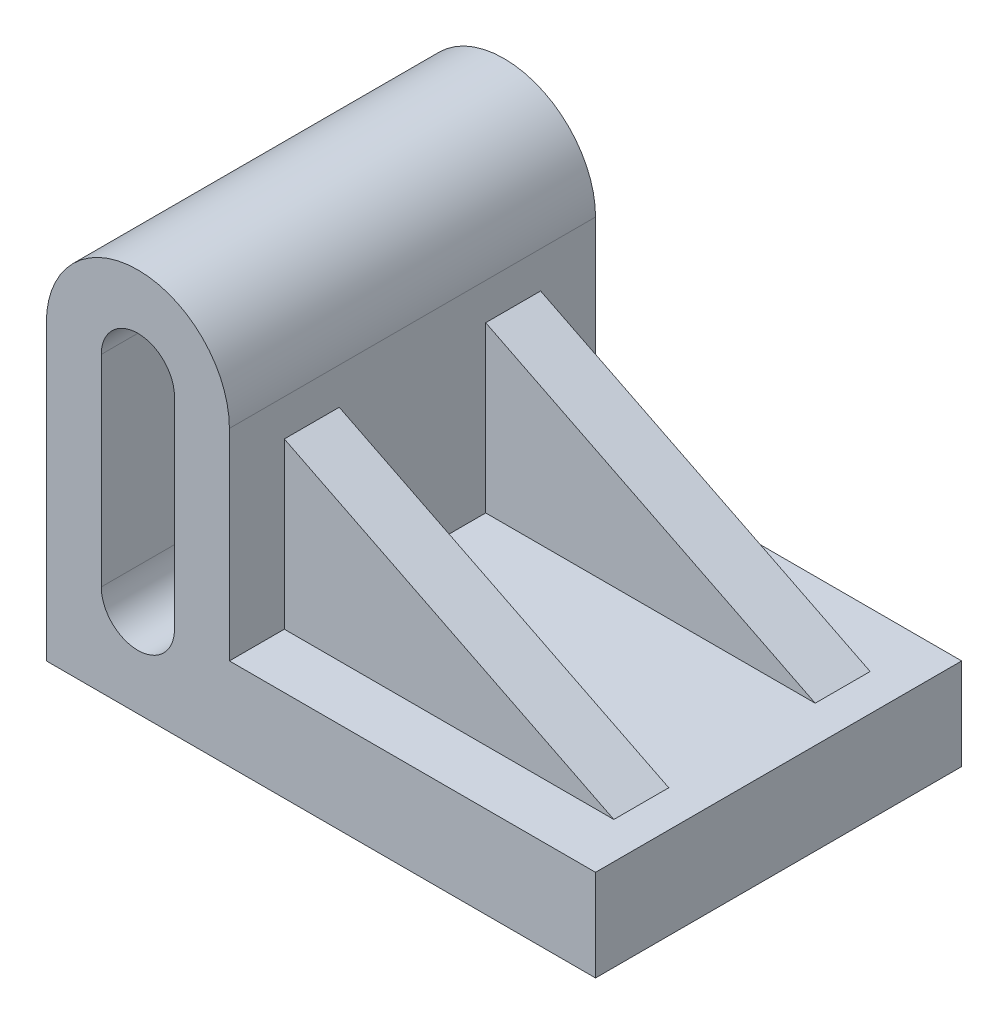
ISO-10303-21;
HEADER;
FILE_DESCRIPTION(('STEP AP214'),'2;1');
FILE_NAME('part.step','',(''),(''),'','','');
FILE_SCHEMA(('AUTOMOTIVE_DESIGN { 1 0 10303 214 1 1 1 1 }'));
ENDSEC;
DATA;
#1=APPLICATION_CONTEXT('core data for automotive mechanical design processes');
#2=APPLICATION_PROTOCOL_DEFINITION('international standard','automotive_design',2000,#1);
#3=PRODUCT_CONTEXT('',#1,'mechanical');
#4=PRODUCT('Part','Part','',(#3));
#5=PRODUCT_RELATED_PRODUCT_CATEGORY('part','',(#4));
#6=PRODUCT_DEFINITION_FORMATION('','',#4);
#7=PRODUCT_DEFINITION_CONTEXT('part definition',#1,'design');
#8=PRODUCT_DEFINITION('design','',#6,#7);
#9=PRODUCT_DEFINITION_SHAPE('','',#8);
#10=(LENGTH_UNIT() NAMED_UNIT(*) SI_UNIT(.MILLI.,.METRE.));
#11=(NAMED_UNIT(*) PLANE_ANGLE_UNIT() SI_UNIT($,.RADIAN.));
#12=(NAMED_UNIT(*) SI_UNIT($,.STERADIAN.) SOLID_ANGLE_UNIT());
#13=UNCERTAINTY_MEASURE_WITH_UNIT(LENGTH_MEASURE(1.E-05),#10,'distance_accuracy_value','');
#14=(GEOMETRIC_REPRESENTATION_CONTEXT(3) GLOBAL_UNCERTAINTY_ASSIGNED_CONTEXT((#13)) GLOBAL_UNIT_ASSIGNED_CONTEXT((#10,
#11,#12)) REPRESENTATION_CONTEXT('',''));
#15=CARTESIAN_POINT('',(0.,0.,0.));
#16=DIRECTION('',(0.,0.,1.));
#17=DIRECTION('',(1.,0.,0.));
#18=AXIS2_PLACEMENT_3D('',#15,#16,#17);
#19=CARTESIAN_POINT('',(-52.1171171171171,57.8153153153153,-100.));
#20=DIRECTION('',(1.,0.,0.));
#21=DIRECTION('',(0.,1.,0.));
#22=AXIS2_PLACEMENT_3D('',#19,#20,#21);
#23=PLANE('',#22);
#24=DIRECTION('',(0.,1.,0.));
#25=VECTOR('',#24,1.);
#26=CARTESIAN_POINT('',(-52.1171171171172,47.8153153153153,-70.));
#27=LINE('',#26,#25);
#28=CARTESIAN_POINT('',(-52.1171171171172,2.81531531531532,-70.));
#29=VERTEX_POINT('',#28);
#30=CARTESIAN_POINT('',(-52.1171171171171,47.8153153153153,-70.));
#31=VERTEX_POINT('',#30);
#32=EDGE_CURVE('E181',#29,#31,#27,.T.);
#33=ORIENTED_EDGE('',*,*,#32,.T.);
#34=DIRECTION('',(0.,0.,1.));
#35=VECTOR('',#34,1.);
#36=CARTESIAN_POINT('',(-52.1171171171171,47.8153153153153,-15.));
#37=LINE('',#36,#35);
#38=CARTESIAN_POINT('',(-52.1171171171171,47.8153153153153,-85.));
#39=VERTEX_POINT('',#38);
#40=EDGE_CURVE('E61',#39,#31,#37,.T.);
#41=ORIENTED_EDGE('',*,*,#40,.F.);
#42=DIRECTION('',(0.,-1.,0.));
#43=VECTOR('',#42,1.);
#44=CARTESIAN_POINT('',(-52.1171171171171,47.8153153153153,-85.));
#45=LINE('',#44,#43);
#46=CARTESIAN_POINT('',(-52.1171171171171,2.81531531531532,-85.));
#47=VERTEX_POINT('',#46);
#48=EDGE_CURVE('E170',#39,#47,#45,.T.);
#49=ORIENTED_EDGE('',*,*,#48,.T.);
#50=DIRECTION('',(0.,0.,1.));
#51=VECTOR('',#50,1.);
#52=CARTESIAN_POINT('',(-52.1171171171171,2.81531531531532,-100.));
#53=LINE('',#52,#51);
#54=CARTESIAN_POINT('',(-52.1171171171171,2.81531531531532,-100.));
#55=VERTEX_POINT('',#54);
#56=EDGE_CURVE('E293',#55,#47,#53,.T.);
#57=ORIENTED_EDGE('',*,*,#56,.F.);
#58=DIRECTION('',(0.,1.,0.));
#59=VECTOR('',#58,1.);
#60=CARTESIAN_POINT('',(-52.1171171171171,57.8153153153153,-100.));
#61=LINE('',#60,#59);
#62=CARTESIAN_POINT('',(-52.1171171171171,57.8153153153153,-100.));
#63=VERTEX_POINT('',#62);
#64=EDGE_CURVE('E264',#55,#63,#61,.T.);
#65=ORIENTED_EDGE('',*,*,#64,.T.);
#66=DIRECTION('',(0.,0.,1.));
#67=VECTOR('',#66,1.);
#68=CARTESIAN_POINT('',(-52.1171171171171,57.8153153153153,-100.));
#69=LINE('',#68,#67);
#70=CARTESIAN_POINT('',(-52.1171171171171,57.8153153153153,0.));
#71=VERTEX_POINT('',#70);
#72=EDGE_CURVE('E54',#63,#71,#69,.T.);
#73=ORIENTED_EDGE('',*,*,#72,.T.);
#74=DIRECTION('',(0.,1.,0.));
#75=VECTOR('',#74,1.);
#76=CARTESIAN_POINT('',(-52.1171171171171,57.8153153153153,0.));
#77=LINE('',#76,#75);
#78=CARTESIAN_POINT('',(-52.1171171171171,2.81531531531532,0.));
#79=VERTEX_POINT('',#78);
#80=EDGE_CURVE('E249',#79,#71,#77,.T.);
#81=ORIENTED_EDGE('',*,*,#80,.F.);
#82=CARTESIAN_POINT('',(-52.1171171171171,2.81531531531532,-15.));
#83=VERTEX_POINT('',#82);
#84=EDGE_CURVE('E296',#83,#79,#53,.T.);
#85=ORIENTED_EDGE('',*,*,#84,.F.);
#86=DIRECTION('',(0.,-1.,0.));
#87=VECTOR('',#86,1.);
#88=CARTESIAN_POINT('',(-52.1171171171171,47.8153153153153,-15.));
#89=LINE('',#88,#87);
#90=CARTESIAN_POINT('',(-52.1171171171171,47.8153153153153,-15.));
#91=VERTEX_POINT('',#90);
#92=EDGE_CURVE('E68',#91,#83,#89,.T.);
#93=ORIENTED_EDGE('',*,*,#92,.F.);
#94=CARTESIAN_POINT('',(-52.1171171171171,47.8153153153153,-30.));
#95=VERTEX_POINT('',#94);
#96=EDGE_CURVE('E183',#95,#91,#37,.T.);
#97=ORIENTED_EDGE('',*,*,#96,.F.);
#98=DIRECTION('',(0.,-1.,0.));
#99=VECTOR('',#98,1.);
#100=CARTESIAN_POINT('',(-52.1171171171171,47.8153153153153,-30.));
#101=LINE('',#100,#99);
#102=CARTESIAN_POINT('',(-52.1171171171171,2.81531531531532,-30.));
#103=VERTEX_POINT('',#102);
#104=EDGE_CURVE('E343',#95,#103,#101,.T.);
#105=ORIENTED_EDGE('',*,*,#104,.T.);
#106=DIRECTION('',(0.,0.,-1.));
#107=VECTOR('',#106,1.);
#108=CARTESIAN_POINT('',(-52.1171171171171,2.81531531531532,-30.));
#109=LINE('',#108,#107);
#110=EDGE_CURVE('E352',#103,#29,#109,.T.);
#111=ORIENTED_EDGE('',*,*,#110,.T.);
#112=EDGE_LOOP('',(#33,#41,#49,#57,#65,#73,#81,#85,#93,#97,#105,#111));
#113=FACE_BOUND('',#112,.T.);
#114=ADVANCED_FACE('F45',(#113),#23,.T.);
#115=CARTESIAN_POINT('',(47.8828828828829,2.81531531531532,-100.));
#116=DIRECTION('',(0.,1.,0.));
#117=DIRECTION('',(-1.,0.,0.));
#118=AXIS2_PLACEMENT_3D('',#115,#116,#117);
#119=PLANE('',#118);
#120=DIRECTION('',(1.,0.,0.));
#121=VECTOR('',#120,1.);
#122=CARTESIAN_POINT('',(-52.1171171171171,2.81531531531532,-30.));
#123=LINE('',#122,#121);
#124=CARTESIAN_POINT('',(37.8828828828828,2.81531531531532,-30.));
#125=VERTEX_POINT('',#124);
#126=EDGE_CURVE('E191',#103,#125,#123,.T.);
#127=ORIENTED_EDGE('',*,*,#126,.T.);
#128=DIRECTION('',(0.,0.,-1.));
#129=VECTOR('',#128,1.);
#130=CARTESIAN_POINT('',(37.8828828828828,2.81531531531532,-15.));
#131=LINE('',#130,#129);
#132=CARTESIAN_POINT('',(37.8828828828828,2.81531531531532,-15.));
#133=VERTEX_POINT('',#132);
#134=EDGE_CURVE('E193',#133,#125,#131,.T.);
#135=ORIENTED_EDGE('',*,*,#134,.F.);
#136=DIRECTION('',(1.,0.,0.));
#137=VECTOR('',#136,1.);
#138=CARTESIAN_POINT('',(37.8828828828828,2.81531531531532,-15.));
#139=LINE('',#138,#137);
#140=EDGE_CURVE('E188',#83,#133,#139,.T.);
#141=ORIENTED_EDGE('',*,*,#140,.F.);
#142=ORIENTED_EDGE('',*,*,#84,.T.);
#143=DIRECTION('',(-1.,0.,0.));
#144=VECTOR('',#143,1.);
#145=CARTESIAN_POINT('',(47.8828828828829,2.81531531531532,0.));
#146=LINE('',#145,#144);
#147=CARTESIAN_POINT('',(47.8828828828829,2.81531531531532,0.));
#148=VERTEX_POINT('',#147);
#149=EDGE_CURVE('E284',#148,#79,#146,.T.);
#150=ORIENTED_EDGE('',*,*,#149,.F.);
#151=DIRECTION('',(0.,0.,1.));
#152=VECTOR('',#151,1.);
#153=CARTESIAN_POINT('',(47.8828828828829,2.81531531531532,-100.));
#154=LINE('',#153,#152);
#155=CARTESIAN_POINT('',(47.8828828828829,2.81531531531532,-100.));
#156=VERTEX_POINT('',#155);
#157=EDGE_CURVE('E297',#156,#148,#154,.T.);
#158=ORIENTED_EDGE('',*,*,#157,.F.);
#159=DIRECTION('',(-1.,0.,0.));
#160=VECTOR('',#159,1.);
#161=CARTESIAN_POINT('',(47.8828828828829,2.81531531531532,-100.));
#162=LINE('',#161,#160);
#163=EDGE_CURVE('E260',#156,#55,#162,.T.);
#164=ORIENTED_EDGE('',*,*,#163,.T.);
#165=ORIENTED_EDGE('',*,*,#56,.T.);
#166=DIRECTION('',(-1.,0.,0.));
#167=VECTOR('',#166,1.);
#168=CARTESIAN_POINT('',(37.8828828828828,2.81531531531532,-85.));
#169=LINE('',#168,#167);
#170=CARTESIAN_POINT('',(37.8828828828828,2.81531531531532,-85.));
#171=VERTEX_POINT('',#170);
#172=EDGE_CURVE('E172',#171,#47,#169,.T.);
#173=ORIENTED_EDGE('',*,*,#172,.F.);
#174=CARTESIAN_POINT('',(37.8828828828828,2.81531531531532,-70.));
#175=VERTEX_POINT('',#174);
#176=EDGE_CURVE('E162',#175,#171,#131,.T.);
#177=ORIENTED_EDGE('',*,*,#176,.F.);
#178=DIRECTION('',(1.,0.,0.));
#179=VECTOR('',#178,1.);
#180=CARTESIAN_POINT('',(-52.1171171171172,2.81531531531532,-70.));
#181=LINE('',#180,#179);
#182=EDGE_CURVE('E358',#29,#175,#181,.T.);
#183=ORIENTED_EDGE('',*,*,#182,.F.);
#184=ORIENTED_EDGE('',*,*,#110,.F.);
#185=EDGE_LOOP('',(#127,#135,#141,#142,#150,#158,#164,#165,#173,#177,#183,#184));
#186=FACE_BOUND('',#185,.T.);
#187=ADVANCED_FACE('F333',(#186),#119,.T.);
#188=CARTESIAN_POINT('',(-77.1171171171171,57.8153153153153,-100.));
#189=DIRECTION('',(0.,0.,1.));
#190=DIRECTION('',(1.,0.,0.));
#191=AXIS2_PLACEMENT_3D('',#188,#189,#190);
#192=CYLINDRICAL_SURFACE('',#191,25.);
#193=CARTESIAN_POINT('',(-77.1171171171171,57.8153153153153,0.));
#194=DIRECTION('',(0.,0.,1.));
#195=DIRECTION('',(1.,0.,0.));
#196=AXIS2_PLACEMENT_3D('',#193,#194,#195);
#197=CIRCLE('',#196,25.);
#198=CARTESIAN_POINT('',(-102.117117117117,57.8153153153153,0.));
#199=VERTEX_POINT('',#198);
#200=EDGE_CURVE('E234',#71,#199,#197,.T.);
#201=ORIENTED_EDGE('',*,*,#200,.F.);
#202=ORIENTED_EDGE('',*,*,#72,.F.);
#203=CARTESIAN_POINT('',(-77.1171171171171,57.8153153153153,-100.));
#204=DIRECTION('',(0.,0.,1.));
#205=DIRECTION('',(1.,0.,0.));
#206=AXIS2_PLACEMENT_3D('',#203,#204,#205);
#207=CIRCLE('',#206,25.);
#208=CARTESIAN_POINT('',(-102.117117117117,57.8153153153153,-100.));
#209=VERTEX_POINT('',#208);
#210=EDGE_CURVE('E244',#63,#209,#207,.T.);
#211=ORIENTED_EDGE('',*,*,#210,.T.);
#212=DIRECTION('',(0.,0.,1.));
#213=VECTOR('',#212,1.);
#214=CARTESIAN_POINT('',(-102.117117117117,57.8153153153153,-100.));
#215=LINE('',#214,#213);
#216=EDGE_CURVE('E268',#209,#199,#215,.T.);
#217=ORIENTED_EDGE('',*,*,#216,.T.);
#218=EDGE_LOOP('',(#201,#202,#211,#217));
#219=FACE_BOUND('',#218,.T.);
#220=ADVANCED_FACE('F47',(#219),#192,.T.);
#221=CARTESIAN_POINT('',(47.8828828828829,-22.1846846846847,-100.));
#222=DIRECTION('',(1.,0.,0.));
#223=DIRECTION('',(0.,0.,-1.));
#224=AXIS2_PLACEMENT_3D('',#221,#222,#223);
#225=PLANE('',#224);
#226=DIRECTION('',(0.,1.,0.));
#227=VECTOR('',#226,1.);
#228=CARTESIAN_POINT('',(47.8828828828829,-22.1846846846847,0.));
#229=LINE('',#228,#227);
#230=CARTESIAN_POINT('',(47.8828828828829,-22.1846846846847,0.));
#231=VERTEX_POINT('',#230);
#232=EDGE_CURVE('E280',#231,#148,#229,.T.);
#233=ORIENTED_EDGE('',*,*,#232,.F.);
#234=DIRECTION('',(0.,0.,1.));
#235=VECTOR('',#234,1.);
#236=CARTESIAN_POINT('',(47.8828828828829,-22.1846846846847,-100.));
#237=LINE('',#236,#235);
#238=CARTESIAN_POINT('',(47.8828828828829,-22.1846846846847,-100.));
#239=VERTEX_POINT('',#238);
#240=EDGE_CURVE('E300',#239,#231,#237,.T.);
#241=ORIENTED_EDGE('',*,*,#240,.F.);
#242=DIRECTION('',(0.,1.,0.));
#243=VECTOR('',#242,1.);
#244=CARTESIAN_POINT('',(47.8828828828829,-22.1846846846847,-100.));
#245=LINE('',#244,#243);
#246=EDGE_CURVE('E256',#239,#156,#245,.T.);
#247=ORIENTED_EDGE('',*,*,#246,.T.);
#248=ORIENTED_EDGE('',*,*,#157,.T.);
#249=EDGE_LOOP('',(#233,#241,#247,#248));
#250=FACE_BOUND('',#249,.T.);
#251=ADVANCED_FACE('F330',(#250),#225,.T.);
#252=CARTESIAN_POINT('',(-102.117117117117,-22.1846846846847,-100.));
#253=DIRECTION('',(0.,-1.,0.));
#254=DIRECTION('',(0.,0.,-1.));
#255=AXIS2_PLACEMENT_3D('',#252,#253,#254);
#256=PLANE('',#255);
#257=DIRECTION('',(1.,0.,0.));
#258=VECTOR('',#257,1.);
#259=CARTESIAN_POINT('',(-102.117117117117,-22.1846846846847,0.));
#260=LINE('',#259,#258);
#261=CARTESIAN_POINT('',(-102.117117117117,-22.1846846846847,0.));
#262=VERTEX_POINT('',#261);
#263=EDGE_CURVE('E276',#262,#231,#260,.T.);
#264=ORIENTED_EDGE('',*,*,#263,.F.);
#265=DIRECTION('',(0.,0.,1.));
#266=VECTOR('',#265,1.);
#267=CARTESIAN_POINT('',(-102.117117117117,-22.1846846846847,-100.));
#268=LINE('',#267,#266);
#269=CARTESIAN_POINT('',(-102.117117117117,-22.1846846846847,-100.));
#270=VERTEX_POINT('',#269);
#271=EDGE_CURVE('E303',#270,#262,#268,.T.);
#272=ORIENTED_EDGE('',*,*,#271,.F.);
#273=DIRECTION('',(1.,0.,0.));
#274=VECTOR('',#273,1.);
#275=CARTESIAN_POINT('',(-102.117117117117,-22.1846846846847,-100.));
#276=LINE('',#275,#274);
#277=EDGE_CURVE('E252',#270,#239,#276,.T.);
#278=ORIENTED_EDGE('',*,*,#277,.T.);
#279=ORIENTED_EDGE('',*,*,#240,.T.);
#280=EDGE_LOOP('',(#264,#272,#278,#279));
#281=FACE_BOUND('',#280,.T.);
#282=ADVANCED_FACE('F327',(#281),#256,.T.);
#283=CARTESIAN_POINT('',(-102.117117117117,2.81531531531532,-100.));
#284=DIRECTION('',(-1.,0.,0.));
#285=DIRECTION('',(0.,-1.,0.));
#286=AXIS2_PLACEMENT_3D('',#283,#284,#285);
#287=PLANE('',#286);
#288=DIRECTION('',(0.,-1.,0.));
#289=VECTOR('',#288,1.);
#290=CARTESIAN_POINT('',(-102.117117117117,2.81531531531532,0.));
#291=LINE('',#290,#289);
#292=EDGE_CURVE('E272',#199,#262,#291,.T.);
#293=ORIENTED_EDGE('',*,*,#292,.F.);
#294=ORIENTED_EDGE('',*,*,#216,.F.);
#295=DIRECTION('',(0.,-1.,0.));
#296=VECTOR('',#295,1.);
#297=CARTESIAN_POINT('',(-102.117117117117,57.8153153153153,-100.));
#298=LINE('',#297,#296);
#299=EDGE_CURVE('E248',#209,#270,#298,.T.);
#300=ORIENTED_EDGE('',*,*,#299,.T.);
#301=ORIENTED_EDGE('',*,*,#271,.T.);
#302=EDGE_LOOP('',(#293,#294,#300,#301));
#303=FACE_BOUND('',#302,.T.);
#304=ADVANCED_FACE('F324',(#303),#287,.T.);
#305=CARTESIAN_POINT('',(-77.1171171171171,57.8153153153153,-100.));
#306=DIRECTION('',(0.,0.,1.));
#307=DIRECTION('',(1.,0.,0.));
#308=AXIS2_PLACEMENT_3D('',#305,#306,#307);
#309=PLANE('',#308);
#310=DIRECTION('',(0.,1.,0.));
#311=VECTOR('',#310,1.);
#312=CARTESIAN_POINT('',(-67.1171171171171,57.8153153153153,-100.));
#313=LINE('',#312,#311);
#314=CARTESIAN_POINT('',(-67.1171171171171,2.81531531531532,-100.));
#315=VERTEX_POINT('',#314);
#316=CARTESIAN_POINT('',(-67.1171171171171,57.8153153153153,-100.));
#317=VERTEX_POINT('',#316);
#318=EDGE_CURVE('E213',#315,#317,#313,.T.);
#319=ORIENTED_EDGE('',*,*,#318,.T.);
#320=CARTESIAN_POINT('',(-77.1171171171171,57.8153153153153,-100.));
#321=DIRECTION('',(0.,0.,1.));
#322=DIRECTION('',(1.,0.,0.));
#323=AXIS2_PLACEMENT_3D('',#320,#321,#322);
#324=CIRCLE('',#323,10.);
#325=CARTESIAN_POINT('',(-87.1171171171171,57.8153153153153,-100.));
#326=VERTEX_POINT('',#325);
#327=EDGE_CURVE('E200',#317,#326,#324,.T.);
#328=ORIENTED_EDGE('',*,*,#327,.T.);
#329=DIRECTION('',(0.,-1.,0.));
#330=VECTOR('',#329,1.);
#331=CARTESIAN_POINT('',(-87.1171171171171,57.8153153153153,-100.));
#332=LINE('',#331,#330);
#333=CARTESIAN_POINT('',(-87.1171171171171,2.81531531531532,-100.));
#334=VERTEX_POINT('',#333);
#335=EDGE_CURVE('E204',#326,#334,#332,.T.);
#336=ORIENTED_EDGE('',*,*,#335,.T.);
#337=CARTESIAN_POINT('',(-77.1171171171171,2.81531531531532,-100.));
#338=DIRECTION('',(0.,0.,1.));
#339=DIRECTION('',(1.,0.,0.));
#340=AXIS2_PLACEMENT_3D('',#337,#338,#339);
#341=CIRCLE('',#340,9.99999999999997);
#342=EDGE_CURVE('E209',#334,#315,#341,.T.);
#343=ORIENTED_EDGE('',*,*,#342,.T.);
#344=EDGE_LOOP('',(#319,#328,#336,#343));
#345=FACE_BOUND('',#344,.T.);
#346=ORIENTED_EDGE('',*,*,#210,.F.);
#347=ORIENTED_EDGE('',*,*,#64,.F.);
#348=ORIENTED_EDGE('',*,*,#163,.F.);
#349=ORIENTED_EDGE('',*,*,#246,.F.);
#350=ORIENTED_EDGE('',*,*,#277,.F.);
#351=ORIENTED_EDGE('',*,*,#299,.F.);
#352=EDGE_LOOP('',(#346,#347,#348,#349,#350,#351));
#353=FACE_BOUND('',#352,.T.);
#354=ADVANCED_FACE('F319',(#345,#353),#309,.F.);
#355=CARTESIAN_POINT('',(-77.1171171171171,57.8153153153153,0.));
#356=DIRECTION('',(0.,0.,1.));
#357=DIRECTION('',(1.,0.,0.));
#358=AXIS2_PLACEMENT_3D('',#355,#356,#357);
#359=PLANE('',#358);
#360=CARTESIAN_POINT('',(-77.1171171171171,57.8153153153153,0.));
#361=DIRECTION('',(0.,0.,1.));
#362=DIRECTION('',(1.,0.,0.));
#363=AXIS2_PLACEMENT_3D('',#360,#361,#362);
#364=CIRCLE('',#363,10.);
#365=CARTESIAN_POINT('',(-67.1171171171171,57.8153153153153,0.));
#366=VERTEX_POINT('',#365);
#367=CARTESIAN_POINT('',(-87.1171171171171,57.8153153153153,0.));
#368=VERTEX_POINT('',#367);
#369=EDGE_CURVE('E176',#366,#368,#364,.T.);
#370=ORIENTED_EDGE('',*,*,#369,.F.);
#371=DIRECTION('',(0.,1.,0.));
#372=VECTOR('',#371,1.);
#373=CARTESIAN_POINT('',(-67.1171171171171,57.8153153153153,0.));
#374=LINE('',#373,#372);
#375=CARTESIAN_POINT('',(-67.1171171171171,2.81531531531532,0.));
#376=VERTEX_POINT('',#375);
#377=EDGE_CURVE('E205',#376,#366,#374,.T.);
#378=ORIENTED_EDGE('',*,*,#377,.F.);
#379=CARTESIAN_POINT('',(-77.1171171171171,2.81531531531532,0.));
#380=DIRECTION('',(0.,0.,1.));
#381=DIRECTION('',(1.,0.,0.));
#382=AXIS2_PLACEMENT_3D('',#379,#380,#381);
#383=CIRCLE('',#382,9.99999999999997);
#384=CARTESIAN_POINT('',(-87.1171171171171,2.81531531531532,0.));
#385=VERTEX_POINT('',#384);
#386=EDGE_CURVE('E224',#385,#376,#383,.T.);
#387=ORIENTED_EDGE('',*,*,#386,.F.);
#388=DIRECTION('',(0.,-1.,0.));
#389=VECTOR('',#388,1.);
#390=CARTESIAN_POINT('',(-87.1171171171171,57.8153153153153,0.));
#391=LINE('',#390,#389);
#392=EDGE_CURVE('E220',#368,#385,#391,.T.);
#393=ORIENTED_EDGE('',*,*,#392,.F.);
#394=EDGE_LOOP('',(#370,#378,#387,#393));
#395=FACE_BOUND('',#394,.T.);
#396=ORIENTED_EDGE('',*,*,#200,.T.);
#397=ORIENTED_EDGE('',*,*,#292,.T.);
#398=ORIENTED_EDGE('',*,*,#263,.T.);
#399=ORIENTED_EDGE('',*,*,#232,.T.);
#400=ORIENTED_EDGE('',*,*,#149,.T.);
#401=ORIENTED_EDGE('',*,*,#80,.T.);
#402=EDGE_LOOP('',(#396,#397,#398,#399,#400,#401));
#403=FACE_BOUND('',#402,.T.);
#404=ADVANCED_FACE('F313',(#395,#403),#359,.T.);
#405=CARTESIAN_POINT('',(-77.1171171171171,57.8153153153153,-100.));
#406=DIRECTION('',(0.,0.,1.));
#407=DIRECTION('',(1.,0.,0.));
#408=AXIS2_PLACEMENT_3D('',#405,#406,#407);
#409=CYLINDRICAL_SURFACE('',#408,10.);
#410=ORIENTED_EDGE('',*,*,#369,.T.);
#411=DIRECTION('',(0.,0.,1.));
#412=VECTOR('',#411,1.);
#413=CARTESIAN_POINT('',(-87.1171171171171,57.8153153153153,-100.));
#414=LINE('',#413,#412);
#415=EDGE_CURVE('E217',#326,#368,#414,.T.);
#416=ORIENTED_EDGE('',*,*,#415,.F.);
#417=ORIENTED_EDGE('',*,*,#327,.F.);
#418=DIRECTION('',(0.,0.,1.));
#419=VECTOR('',#418,1.);
#420=CARTESIAN_POINT('',(-67.1171171171171,57.8153153153153,-100.));
#421=LINE('',#420,#419);
#422=EDGE_CURVE('E231',#317,#366,#421,.T.);
#423=ORIENTED_EDGE('',*,*,#422,.T.);
#424=EDGE_LOOP('',(#410,#416,#417,#423));
#425=FACE_BOUND('',#424,.T.);
#426=ADVANCED_FACE('F394',(#425),#409,.F.);
#427=CARTESIAN_POINT('',(-67.1171171171171,57.8153153153153,-100.));
#428=DIRECTION('',(1.,0.,0.));
#429=DIRECTION('',(0.,1.,0.));
#430=AXIS2_PLACEMENT_3D('',#427,#428,#429);
#431=PLANE('',#430);
#432=ORIENTED_EDGE('',*,*,#377,.T.);
#433=ORIENTED_EDGE('',*,*,#422,.F.);
#434=ORIENTED_EDGE('',*,*,#318,.F.);
#435=DIRECTION('',(0.,0.,1.));
#436=VECTOR('',#435,1.);
#437=CARTESIAN_POINT('',(-67.1171171171171,2.81531531531532,-100.));
#438=LINE('',#437,#436);
#439=EDGE_CURVE('E235',#315,#376,#438,.T.);
#440=ORIENTED_EDGE('',*,*,#439,.T.);
#441=EDGE_LOOP('',(#432,#433,#434,#440));
#442=FACE_BOUND('',#441,.T.);
#443=ADVANCED_FACE('F399',(#442),#431,.F.);
#444=CARTESIAN_POINT('',(-77.1171171171171,2.81531531531532,-100.));
#445=DIRECTION('',(0.,0.,1.));
#446=DIRECTION('',(1.,0.,0.));
#447=AXIS2_PLACEMENT_3D('',#444,#445,#446);
#448=CYLINDRICAL_SURFACE('',#447,9.99999999999997);
#449=ORIENTED_EDGE('',*,*,#386,.T.);
#450=ORIENTED_EDGE('',*,*,#439,.F.);
#451=ORIENTED_EDGE('',*,*,#342,.F.);
#452=DIRECTION('',(0.,0.,1.));
#453=VECTOR('',#452,1.);
#454=CARTESIAN_POINT('',(-87.1171171171171,2.81531531531532,-100.));
#455=LINE('',#454,#453);
#456=EDGE_CURVE('E238',#334,#385,#455,.T.);
#457=ORIENTED_EDGE('',*,*,#456,.T.);
#458=EDGE_LOOP('',(#449,#450,#451,#457));
#459=FACE_BOUND('',#458,.T.);
#460=ADVANCED_FACE('F403',(#459),#448,.F.);
#461=CARTESIAN_POINT('',(-87.1171171171171,57.8153153153153,-100.));
#462=DIRECTION('',(-1.,0.,0.));
#463=DIRECTION('',(0.,-1.,0.));
#464=AXIS2_PLACEMENT_3D('',#461,#462,#463);
#465=PLANE('',#464);
#466=ORIENTED_EDGE('',*,*,#392,.T.);
#467=ORIENTED_EDGE('',*,*,#456,.F.);
#468=ORIENTED_EDGE('',*,*,#335,.F.);
#469=ORIENTED_EDGE('',*,*,#415,.T.);
#470=EDGE_LOOP('',(#466,#467,#468,#469));
#471=FACE_BOUND('',#470,.T.);
#472=ADVANCED_FACE('F401',(#471),#465,.F.);
#473=CARTESIAN_POINT('',(37.8828828828828,47.8153153153153,-85.));
#474=DIRECTION('',(0.,0.,1.));
#475=DIRECTION('',(1.,0.,0.));
#476=AXIS2_PLACEMENT_3D('',#473,#474,#475);
#477=PLANE('',#476);
#478=ORIENTED_EDGE('',*,*,#48,.F.);
#479=DIRECTION('',(0.894427190999916,-0.447213595499958,0.));
#480=VECTOR('',#479,1.);
#481=CARTESIAN_POINT('',(-52.1171171171171,47.8153153153153,-85.));
#482=LINE('',#481,#480);
#483=EDGE_CURVE('E158',#39,#171,#482,.T.);
#484=ORIENTED_EDGE('',*,*,#483,.T.);
#485=ORIENTED_EDGE('',*,*,#172,.T.);
#486=EDGE_LOOP('',(#478,#484,#485));
#487=FACE_BOUND('',#486,.T.);
#488=ADVANCED_FACE('F171',(#487),#477,.F.);
#489=CARTESIAN_POINT('',(37.8828828828828,47.8153153153153,-15.));
#490=DIRECTION('',(0.,0.,-1.));
#491=DIRECTION('',(-1.,0.,0.));
#492=AXIS2_PLACEMENT_3D('',#489,#490,#491);
#493=PLANE('',#492);
#494=ORIENTED_EDGE('',*,*,#140,.T.);
#495=DIRECTION('',(0.894427190999916,-0.447213595499958,0.));
#496=VECTOR('',#495,1.);
#497=CARTESIAN_POINT('',(-52.1171171171171,47.8153153153153,-15.));
#498=LINE('',#497,#496);
#499=EDGE_CURVE('E167',#91,#133,#498,.T.);
#500=ORIENTED_EDGE('',*,*,#499,.F.);
#501=ORIENTED_EDGE('',*,*,#92,.T.);
#502=EDGE_LOOP('',(#494,#500,#501));
#503=FACE_BOUND('',#502,.T.);
#504=ADVANCED_FACE('F336',(#503),#493,.F.);
#505=CARTESIAN_POINT('',(-52.1171171171171,47.8153153153153,-30.));
#506=DIRECTION('',(0.,0.,1.));
#507=DIRECTION('',(1.,0.,0.));
#508=AXIS2_PLACEMENT_3D('',#505,#506,#507);
#509=PLANE('',#508);
#510=ORIENTED_EDGE('',*,*,#104,.F.);
#511=DIRECTION('',(0.894427190999916,-0.447213595499958,0.));
#512=VECTOR('',#511,1.);
#513=CARTESIAN_POINT('',(-52.1171171171171,47.8153153153153,-30.));
#514=LINE('',#513,#512);
#515=EDGE_CURVE('E166',#95,#125,#514,.T.);
#516=ORIENTED_EDGE('',*,*,#515,.T.);
#517=ORIENTED_EDGE('',*,*,#126,.F.);
#518=EDGE_LOOP('',(#510,#516,#517));
#519=FACE_BOUND('',#518,.T.);
#520=ADVANCED_FACE('F349',(#519),#509,.F.);
#521=CARTESIAN_POINT('',(-52.1171171171172,47.8153153153153,-70.));
#522=DIRECTION('',(0.,0.,-1.));
#523=DIRECTION('',(-1.,0.,0.));
#524=AXIS2_PLACEMENT_3D('',#521,#522,#523);
#525=PLANE('',#524);
#526=ORIENTED_EDGE('',*,*,#182,.T.);
#527=DIRECTION('',(-0.894427190999916,0.447213595499958,0.));
#528=VECTOR('',#527,1.);
#529=CARTESIAN_POINT('',(-52.1171171171171,47.8153153153153,-70.));
#530=LINE('',#529,#528);
#531=EDGE_CURVE('E11',#175,#31,#530,.T.);
#532=ORIENTED_EDGE('',*,*,#531,.T.);
#533=ORIENTED_EDGE('',*,*,#32,.F.);
#534=EDGE_LOOP('',(#526,#532,#533));
#535=FACE_BOUND('',#534,.T.);
#536=ADVANCED_FACE('F364',(#535),#525,.F.);
#537=CARTESIAN_POINT('',(-52.1171171171171,47.8153153153153,-85.));
#538=DIRECTION('',(-0.447213595499958,-0.894427190999916,0.));
#539=DIRECTION('',(0.894427190999916,-0.447213595499958,0.));
#540=AXIS2_PLACEMENT_3D('',#537,#538,#539);
#541=PLANE('',#540);
#542=ORIENTED_EDGE('',*,*,#176,.T.);
#543=ORIENTED_EDGE('',*,*,#483,.F.);
#544=ORIENTED_EDGE('',*,*,#40,.T.);
#545=ORIENTED_EDGE('',*,*,#531,.F.);
#546=EDGE_LOOP('',(#542,#543,#544,#545));
#547=FACE_BOUND('',#546,.T.);
#548=ADVANCED_FACE('F160',(#547),#541,.F.);
#549=ORIENTED_EDGE('',*,*,#96,.T.);
#550=ORIENTED_EDGE('',*,*,#499,.T.);
#551=ORIENTED_EDGE('',*,*,#134,.T.);
#552=ORIENTED_EDGE('',*,*,#515,.F.);
#553=EDGE_LOOP('',(#549,#550,#551,#552));
#554=FACE_BOUND('',#553,.T.);
#555=ADVANCED_FACE('F344',(#554),#541,.F.);
#556=CLOSED_SHELL('',(#114,#187,#220,#251,#282,#304,#354,#404,#426,#443,#460,#472,#488,#504,
#520,#536,#548,#555));
#557=MANIFOLD_SOLID_BREP('B2',#556);
#558=ADVANCED_BREP_SHAPE_REPRESENTATION('',(#18,#557),#14);
#559=SHAPE_DEFINITION_REPRESENTATION(#9,#558);
ENDSEC;
END-ISO-10303-21;
